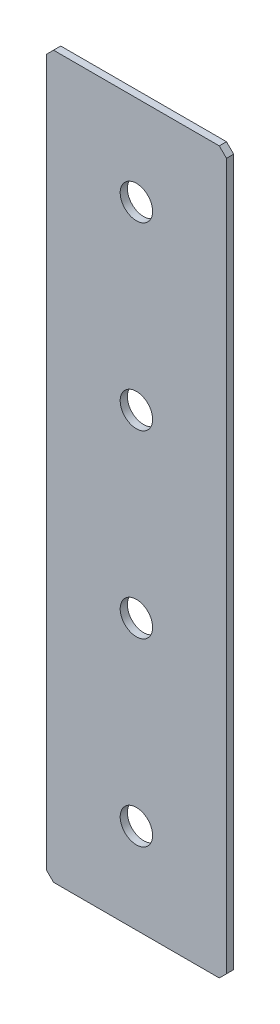
ISO-10303-21;
HEADER;
FILE_DESCRIPTION(('STEP AP214'),'2;1');
FILE_NAME('part.step','',(''),(''),'','','');
FILE_SCHEMA(('AUTOMOTIVE_DESIGN { 1 0 10303 214 1 1 1 1 }'));
ENDSEC;
DATA;
#1=APPLICATION_CONTEXT('core data for automotive mechanical design processes');
#2=APPLICATION_PROTOCOL_DEFINITION('international standard','automotive_design',2000,#1);
#3=PRODUCT_CONTEXT('',#1,'mechanical');
#4=PRODUCT('Part','Part','',(#3));
#5=PRODUCT_RELATED_PRODUCT_CATEGORY('part','',(#4));
#6=PRODUCT_DEFINITION_FORMATION('','',#4);
#7=PRODUCT_DEFINITION_CONTEXT('part definition',#1,'design');
#8=PRODUCT_DEFINITION('design','',#6,#7);
#9=PRODUCT_DEFINITION_SHAPE('','',#8);
#10=(LENGTH_UNIT() NAMED_UNIT(*) SI_UNIT(.MILLI.,.METRE.));
#11=(NAMED_UNIT(*) PLANE_ANGLE_UNIT() SI_UNIT($,.RADIAN.));
#12=(NAMED_UNIT(*) SI_UNIT($,.STERADIAN.) SOLID_ANGLE_UNIT());
#13=UNCERTAINTY_MEASURE_WITH_UNIT(LENGTH_MEASURE(1.E-05),#10,'distance_accuracy_value','');
#14=(GEOMETRIC_REPRESENTATION_CONTEXT(3) GLOBAL_UNCERTAINTY_ASSIGNED_CONTEXT((#13)) GLOBAL_UNIT_ASSIGNED_CONTEXT((#10,
#11,#12)) REPRESENTATION_CONTEXT('',''));
#15=CARTESIAN_POINT('',(0.,0.,0.));
#16=DIRECTION('',(0.,0.,1.));
#17=DIRECTION('',(1.,0.,0.));
#18=AXIS2_PLACEMENT_3D('',#15,#16,#17);
#19=CARTESIAN_POINT('',(25.,-100.,2.));
#20=DIRECTION('',(-1.,0.,0.));
#21=DIRECTION('',(0.,0.,1.));
#22=AXIS2_PLACEMENT_3D('',#19,#20,#21);
#23=PLANE('',#22);
#24=DIRECTION('',(0.,1.,0.));
#25=VECTOR('',#24,1.);
#26=CARTESIAN_POINT('',(25.,-100.,2.));
#27=LINE('',#26,#25);
#28=CARTESIAN_POINT('',(25.,-98.,2.));
#29=VERTEX_POINT('',#28);
#30=CARTESIAN_POINT('',(25.,98.,2.));
#31=VERTEX_POINT('',#30);
#32=EDGE_CURVE('E128',#29,#31,#27,.T.);
#33=ORIENTED_EDGE('',*,*,#32,.F.);
#34=DIRECTION('',(0.,0.,-1.));
#35=VECTOR('',#34,1.);
#36=CARTESIAN_POINT('',(25.,-98.,2.));
#37=LINE('',#36,#35);
#38=CARTESIAN_POINT('',(25.,-98.,0.));
#39=VERTEX_POINT('',#38);
#40=EDGE_CURVE('E154',#29,#39,#37,.T.);
#41=ORIENTED_EDGE('',*,*,#40,.T.);
#42=DIRECTION('',(0.,1.,0.));
#43=VECTOR('',#42,1.);
#44=CARTESIAN_POINT('',(25.,-100.,0.));
#45=LINE('',#44,#43);
#46=CARTESIAN_POINT('',(25.,98.,0.));
#47=VERTEX_POINT('',#46);
#48=EDGE_CURVE('E162',#39,#47,#45,.T.);
#49=ORIENTED_EDGE('',*,*,#48,.T.);
#50=DIRECTION('',(0.,0.,1.));
#51=VECTOR('',#50,1.);
#52=CARTESIAN_POINT('',(25.,98.,2.));
#53=LINE('',#52,#51);
#54=EDGE_CURVE('E152',#47,#31,#53,.T.);
#55=ORIENTED_EDGE('',*,*,#54,.T.);
#56=EDGE_LOOP('',(#33,#41,#49,#55));
#57=FACE_BOUND('',#56,.T.);
#58=ADVANCED_FACE('F37',(#57),#23,.F.);
#59=CARTESIAN_POINT('',(-25.,100.,2.));
#60=DIRECTION('',(0.,-1.,0.));
#61=DIRECTION('',(0.,0.,-1.));
#62=AXIS2_PLACEMENT_3D('',#59,#60,#61);
#63=PLANE('',#62);
#64=DIRECTION('',(-1.,0.,0.));
#65=VECTOR('',#64,1.);
#66=CARTESIAN_POINT('',(-25.,100.,0.));
#67=LINE('',#66,#65);
#68=CARTESIAN_POINT('',(23.,100.,0.));
#69=VERTEX_POINT('',#68);
#70=CARTESIAN_POINT('',(-22.9999999999999,100.,0.));
#71=VERTEX_POINT('',#70);
#72=EDGE_CURVE('E133',#69,#71,#67,.T.);
#73=ORIENTED_EDGE('',*,*,#72,.T.);
#74=DIRECTION('',(0.,0.,1.));
#75=VECTOR('',#74,1.);
#76=CARTESIAN_POINT('',(-22.9999999999999,100.,2.));
#77=LINE('',#76,#75);
#78=CARTESIAN_POINT('',(-22.9999999999999,100.,2.));
#79=VERTEX_POINT('',#78);
#80=EDGE_CURVE('E11',#71,#79,#77,.T.);
#81=ORIENTED_EDGE('',*,*,#80,.T.);
#82=DIRECTION('',(-1.,0.,0.));
#83=VECTOR('',#82,1.);
#84=CARTESIAN_POINT('',(-25.,100.,2.));
#85=LINE('',#84,#83);
#86=CARTESIAN_POINT('',(23.,100.,2.));
#87=VERTEX_POINT('',#86);
#88=EDGE_CURVE('E131',#87,#79,#85,.T.);
#89=ORIENTED_EDGE('',*,*,#88,.F.);
#90=DIRECTION('',(0.,0.,-1.));
#91=VECTOR('',#90,1.);
#92=CARTESIAN_POINT('',(23.,100.,2.));
#93=LINE('',#92,#91);
#94=EDGE_CURVE('E45',#87,#69,#93,.T.);
#95=ORIENTED_EDGE('',*,*,#94,.T.);
#96=EDGE_LOOP('',(#73,#81,#89,#95));
#97=FACE_BOUND('',#96,.T.);
#98=ADVANCED_FACE('F159',(#97),#63,.F.);
#99=CARTESIAN_POINT('',(-25.,-100.,2.));
#100=DIRECTION('',(1.,0.,0.));
#101=DIRECTION('',(0.,0.,-1.));
#102=AXIS2_PLACEMENT_3D('',#99,#100,#101);
#103=PLANE('',#102);
#104=DIRECTION('',(0.,-1.,0.));
#105=VECTOR('',#104,1.);
#106=CARTESIAN_POINT('',(-25.,-100.,0.));
#107=LINE('',#106,#105);
#108=CARTESIAN_POINT('',(-25.,98.,0.));
#109=VERTEX_POINT('',#108);
#110=CARTESIAN_POINT('',(-25.,-98.,0.));
#111=VERTEX_POINT('',#110);
#112=EDGE_CURVE('E129',#109,#111,#107,.T.);
#113=ORIENTED_EDGE('',*,*,#112,.T.);
#114=DIRECTION('',(0.,0.,1.));
#115=VECTOR('',#114,1.);
#116=CARTESIAN_POINT('',(-25.,-98.,2.));
#117=LINE('',#116,#115);
#118=CARTESIAN_POINT('',(-25.,-98.,2.));
#119=VERTEX_POINT('',#118);
#120=EDGE_CURVE('E107',#111,#119,#117,.T.);
#121=ORIENTED_EDGE('',*,*,#120,.T.);
#122=DIRECTION('',(0.,-1.,0.));
#123=VECTOR('',#122,1.);
#124=CARTESIAN_POINT('',(-25.,-100.,2.));
#125=LINE('',#124,#123);
#126=CARTESIAN_POINT('',(-25.,98.,2.));
#127=VERTEX_POINT('',#126);
#128=EDGE_CURVE('E167',#127,#119,#125,.T.);
#129=ORIENTED_EDGE('',*,*,#128,.F.);
#130=DIRECTION('',(0.,0.,-1.));
#131=VECTOR('',#130,1.);
#132=CARTESIAN_POINT('',(-25.,98.,2.));
#133=LINE('',#132,#131);
#134=EDGE_CURVE('E112',#127,#109,#133,.T.);
#135=ORIENTED_EDGE('',*,*,#134,.T.);
#136=EDGE_LOOP('',(#113,#121,#129,#135));
#137=FACE_BOUND('',#136,.T.);
#138=ADVANCED_FACE('F210',(#137),#103,.F.);
#139=CARTESIAN_POINT('',(-25.,-100.,2.));
#140=DIRECTION('',(0.,1.,0.));
#141=DIRECTION('',(0.,0.,1.));
#142=AXIS2_PLACEMENT_3D('',#139,#140,#141);
#143=PLANE('',#142);
#144=DIRECTION('',(1.,0.,0.));
#145=VECTOR('',#144,1.);
#146=CARTESIAN_POINT('',(-25.,-100.,2.));
#147=LINE('',#146,#145);
#148=CARTESIAN_POINT('',(-23.,-100.,2.));
#149=VERTEX_POINT('',#148);
#150=CARTESIAN_POINT('',(23.,-100.,2.));
#151=VERTEX_POINT('',#150);
#152=EDGE_CURVE('E122',#149,#151,#147,.T.);
#153=ORIENTED_EDGE('',*,*,#152,.F.);
#154=DIRECTION('',(0.,0.,-1.));
#155=VECTOR('',#154,1.);
#156=CARTESIAN_POINT('',(-23.,-100.,2.));
#157=LINE('',#156,#155);
#158=CARTESIAN_POINT('',(-23.,-100.,0.));
#159=VERTEX_POINT('',#158);
#160=EDGE_CURVE('E106',#149,#159,#157,.T.);
#161=ORIENTED_EDGE('',*,*,#160,.T.);
#162=DIRECTION('',(1.,0.,0.));
#163=VECTOR('',#162,1.);
#164=CARTESIAN_POINT('',(-25.,-100.,0.));
#165=LINE('',#164,#163);
#166=CARTESIAN_POINT('',(23.,-100.,0.));
#167=VERTEX_POINT('',#166);
#168=EDGE_CURVE('E119',#159,#167,#165,.T.);
#169=ORIENTED_EDGE('',*,*,#168,.T.);
#170=DIRECTION('',(0.,0.,1.));
#171=VECTOR('',#170,1.);
#172=CARTESIAN_POINT('',(23.,-100.,2.));
#173=LINE('',#172,#171);
#174=EDGE_CURVE('E124',#167,#151,#173,.T.);
#175=ORIENTED_EDGE('',*,*,#174,.T.);
#176=EDGE_LOOP('',(#153,#161,#169,#175));
#177=FACE_BOUND('',#176,.T.);
#178=ADVANCED_FACE('F118',(#177),#143,.F.);
#179=CARTESIAN_POINT('',(0.,0.,2.));
#180=DIRECTION('',(0.,0.,-1.));
#181=DIRECTION('',(-1.,0.,0.));
#182=AXIS2_PLACEMENT_3D('',#179,#180,#181);
#183=PLANE('',#182);
#184=CARTESIAN_POINT('',(0.,75.,2.));
#185=DIRECTION('',(0.,0.,1.));
#186=DIRECTION('',(1.,0.,0.));
#187=AXIS2_PLACEMENT_3D('',#184,#185,#186);
#188=CIRCLE('',#187,4.5);
#189=CARTESIAN_POINT('',(4.50000000000001,75.,2.));
#190=VERTEX_POINT('',#189);
#191=EDGE_CURVE('E191',#190,#190,#188,.T.);
#192=ORIENTED_EDGE('',*,*,#191,.F.);
#193=EDGE_LOOP('',(#192));
#194=FACE_BOUND('',#193,.T.);
#195=CARTESIAN_POINT('',(0.,25.,2.));
#196=DIRECTION('',(0.,0.,1.));
#197=DIRECTION('',(1.,0.,0.));
#198=AXIS2_PLACEMENT_3D('',#195,#196,#197);
#199=CIRCLE('',#198,4.5);
#200=CARTESIAN_POINT('',(4.50000000000001,25.,2.));
#201=VERTEX_POINT('',#200);
#202=EDGE_CURVE('E185',#201,#201,#199,.T.);
#203=ORIENTED_EDGE('',*,*,#202,.F.);
#204=EDGE_LOOP('',(#203));
#205=FACE_BOUND('',#204,.T.);
#206=CARTESIAN_POINT('',(0.,-25.,2.));
#207=DIRECTION('',(0.,0.,1.));
#208=DIRECTION('',(1.,0.,0.));
#209=AXIS2_PLACEMENT_3D('',#206,#207,#208);
#210=CIRCLE('',#209,4.5);
#211=CARTESIAN_POINT('',(4.50000000000001,-25.,2.));
#212=VERTEX_POINT('',#211);
#213=EDGE_CURVE('E179',#212,#212,#210,.T.);
#214=ORIENTED_EDGE('',*,*,#213,.F.);
#215=EDGE_LOOP('',(#214));
#216=FACE_BOUND('',#215,.T.);
#217=CARTESIAN_POINT('',(0.,-75.,2.));
#218=DIRECTION('',(0.,0.,1.));
#219=DIRECTION('',(1.,0.,0.));
#220=AXIS2_PLACEMENT_3D('',#217,#218,#219);
#221=CIRCLE('',#220,4.5);
#222=CARTESIAN_POINT('',(4.50000000000001,-75.,2.));
#223=VERTEX_POINT('',#222);
#224=EDGE_CURVE('E173',#223,#223,#221,.T.);
#225=ORIENTED_EDGE('',*,*,#224,.F.);
#226=EDGE_LOOP('',(#225));
#227=FACE_BOUND('',#226,.T.);
#228=ORIENTED_EDGE('',*,*,#128,.T.);
#229=DIRECTION('',(-0.707106781186548,0.707106781186548,0.));
#230=VECTOR('',#229,1.);
#231=CARTESIAN_POINT('',(-23.,-100.,2.));
#232=LINE('',#231,#230);
#233=EDGE_CURVE('E150',#119,#149,#232,.F.);
#234=ORIENTED_EDGE('',*,*,#233,.T.);
#235=ORIENTED_EDGE('',*,*,#152,.T.);
#236=DIRECTION('',(-0.707106781186548,-0.707106781186548,0.));
#237=VECTOR('',#236,1.);
#238=CARTESIAN_POINT('',(25.,-98.,2.));
#239=LINE('',#238,#237);
#240=EDGE_CURVE('E148',#151,#29,#239,.F.);
#241=ORIENTED_EDGE('',*,*,#240,.T.);
#242=ORIENTED_EDGE('',*,*,#32,.T.);
#243=DIRECTION('',(0.707106781186548,-0.707106781186548,0.));
#244=VECTOR('',#243,1.);
#245=CARTESIAN_POINT('',(23.,100.,2.));
#246=LINE('',#245,#244);
#247=EDGE_CURVE('E57',#31,#87,#246,.F.);
#248=ORIENTED_EDGE('',*,*,#247,.T.);
#249=ORIENTED_EDGE('',*,*,#88,.T.);
#250=DIRECTION('',(0.707106781186552,0.707106781186543,0.));
#251=VECTOR('',#250,1.);
#252=CARTESIAN_POINT('',(-25.,98.,2.));
#253=LINE('',#252,#251);
#254=EDGE_CURVE('E146',#79,#127,#253,.F.);
#255=ORIENTED_EDGE('',*,*,#254,.T.);
#256=EDGE_LOOP('',(#228,#234,#235,#241,#242,#248,#249,#255));
#257=FACE_BOUND('',#256,.T.);
#258=ADVANCED_FACE('F197',(#194,#205,#216,#227,#257),#183,.F.);
#259=CARTESIAN_POINT('',(0.,0.,0.));
#260=DIRECTION('',(0.,0.,-1.));
#261=DIRECTION('',(-1.,0.,0.));
#262=AXIS2_PLACEMENT_3D('',#259,#260,#261);
#263=PLANE('',#262);
#264=CARTESIAN_POINT('',(0.,75.,0.));
#265=DIRECTION('',(0.,0.,1.));
#266=DIRECTION('',(1.,0.,0.));
#267=AXIS2_PLACEMENT_3D('',#264,#265,#266);
#268=CIRCLE('',#267,4.5);
#269=CARTESIAN_POINT('',(4.50000000000001,75.,0.));
#270=VERTEX_POINT('',#269);
#271=EDGE_CURVE('E188',#270,#270,#268,.T.);
#272=ORIENTED_EDGE('',*,*,#271,.T.);
#273=EDGE_LOOP('',(#272));
#274=FACE_BOUND('',#273,.T.);
#275=CARTESIAN_POINT('',(0.,25.,0.));
#276=DIRECTION('',(0.,0.,1.));
#277=DIRECTION('',(1.,0.,0.));
#278=AXIS2_PLACEMENT_3D('',#275,#276,#277);
#279=CIRCLE('',#278,4.5);
#280=CARTESIAN_POINT('',(4.50000000000001,25.,0.));
#281=VERTEX_POINT('',#280);
#282=EDGE_CURVE('E182',#281,#281,#279,.T.);
#283=ORIENTED_EDGE('',*,*,#282,.T.);
#284=EDGE_LOOP('',(#283));
#285=FACE_BOUND('',#284,.T.);
#286=CARTESIAN_POINT('',(0.,-25.,0.));
#287=DIRECTION('',(0.,0.,1.));
#288=DIRECTION('',(1.,0.,0.));
#289=AXIS2_PLACEMENT_3D('',#286,#287,#288);
#290=CIRCLE('',#289,4.5);
#291=CARTESIAN_POINT('',(4.50000000000001,-25.,0.));
#292=VERTEX_POINT('',#291);
#293=EDGE_CURVE('E176',#292,#292,#290,.T.);
#294=ORIENTED_EDGE('',*,*,#293,.T.);
#295=EDGE_LOOP('',(#294));
#296=FACE_BOUND('',#295,.T.);
#297=CARTESIAN_POINT('',(0.,-75.,0.));
#298=DIRECTION('',(0.,0.,1.));
#299=DIRECTION('',(1.,0.,0.));
#300=AXIS2_PLACEMENT_3D('',#297,#298,#299);
#301=CIRCLE('',#300,4.5);
#302=CARTESIAN_POINT('',(4.50000000000001,-75.,0.));
#303=VERTEX_POINT('',#302);
#304=EDGE_CURVE('E163',#303,#303,#301,.T.);
#305=ORIENTED_EDGE('',*,*,#304,.T.);
#306=EDGE_LOOP('',(#305));
#307=FACE_BOUND('',#306,.T.);
#308=ORIENTED_EDGE('',*,*,#168,.F.);
#309=DIRECTION('',(0.707106781186548,-0.707106781186548,0.));
#310=VECTOR('',#309,1.);
#311=CARTESIAN_POINT('',(-61.5,-61.5,0.));
#312=LINE('',#311,#310);
#313=EDGE_CURVE('E102',#159,#111,#312,.F.);
#314=ORIENTED_EDGE('',*,*,#313,.T.);
#315=ORIENTED_EDGE('',*,*,#112,.F.);
#316=DIRECTION('',(-0.707106781186552,-0.707106781186543,0.));
#317=VECTOR('',#316,1.);
#318=CARTESIAN_POINT('',(-61.4999999999998,61.5000000000007,0.));
#319=LINE('',#318,#317);
#320=EDGE_CURVE('E139',#109,#71,#319,.F.);
#321=ORIENTED_EDGE('',*,*,#320,.T.);
#322=ORIENTED_EDGE('',*,*,#72,.F.);
#323=DIRECTION('',(-0.707106781186548,0.707106781186548,0.));
#324=VECTOR('',#323,1.);
#325=CARTESIAN_POINT('',(61.5,61.5,0.));
#326=LINE('',#325,#324);
#327=EDGE_CURVE('E123',#69,#47,#326,.F.);
#328=ORIENTED_EDGE('',*,*,#327,.T.);
#329=ORIENTED_EDGE('',*,*,#48,.F.);
#330=DIRECTION('',(0.707106781186548,0.707106781186548,0.));
#331=VECTOR('',#330,1.);
#332=CARTESIAN_POINT('',(61.5,-61.5,0.));
#333=LINE('',#332,#331);
#334=EDGE_CURVE('E113',#39,#167,#333,.F.);
#335=ORIENTED_EDGE('',*,*,#334,.T.);
#336=EDGE_LOOP('',(#308,#314,#315,#321,#322,#328,#329,#335));
#337=FACE_BOUND('',#336,.T.);
#338=ADVANCED_FACE('F126',(#274,#285,#296,#307,#337),#263,.T.);
#339=CARTESIAN_POINT('',(-23.,-100.,2.));
#340=DIRECTION('',(0.707106781186547,0.707106781186547,0.));
#341=DIRECTION('',(0.,0.,-1.));
#342=AXIS2_PLACEMENT_3D('',#339,#340,#341);
#343=PLANE('',#342);
#344=ORIENTED_EDGE('',*,*,#233,.F.);
#345=ORIENTED_EDGE('',*,*,#120,.F.);
#346=ORIENTED_EDGE('',*,*,#313,.F.);
#347=ORIENTED_EDGE('',*,*,#160,.F.);
#348=EDGE_LOOP('',(#344,#345,#346,#347));
#349=FACE_BOUND('',#348,.T.);
#350=ADVANCED_FACE('F105',(#349),#343,.F.);
#351=CARTESIAN_POINT('',(25.,-98.,2.));
#352=DIRECTION('',(-0.707106781186547,0.707106781186547,0.));
#353=DIRECTION('',(0.,0.,-1.));
#354=AXIS2_PLACEMENT_3D('',#351,#352,#353);
#355=PLANE('',#354);
#356=ORIENTED_EDGE('',*,*,#240,.F.);
#357=ORIENTED_EDGE('',*,*,#174,.F.);
#358=ORIENTED_EDGE('',*,*,#334,.F.);
#359=ORIENTED_EDGE('',*,*,#40,.F.);
#360=EDGE_LOOP('',(#356,#357,#358,#359));
#361=FACE_BOUND('',#360,.T.);
#362=ADVANCED_FACE('F214',(#361),#355,.F.);
#363=CARTESIAN_POINT('',(-25.,98.,2.));
#364=DIRECTION('',(0.707106781186543,-0.707106781186552,0.));
#365=DIRECTION('',(0.,0.,-1.));
#366=AXIS2_PLACEMENT_3D('',#363,#364,#365);
#367=PLANE('',#366);
#368=ORIENTED_EDGE('',*,*,#254,.F.);
#369=ORIENTED_EDGE('',*,*,#80,.F.);
#370=ORIENTED_EDGE('',*,*,#320,.F.);
#371=ORIENTED_EDGE('',*,*,#134,.F.);
#372=EDGE_LOOP('',(#368,#369,#370,#371));
#373=FACE_BOUND('',#372,.T.);
#374=ADVANCED_FACE('F212',(#373),#367,.F.);
#375=CARTESIAN_POINT('',(23.,100.,2.));
#376=DIRECTION('',(-0.707106781186547,-0.707106781186547,0.));
#377=DIRECTION('',(0.,0.,-1.));
#378=AXIS2_PLACEMENT_3D('',#375,#376,#377);
#379=PLANE('',#378);
#380=ORIENTED_EDGE('',*,*,#247,.F.);
#381=ORIENTED_EDGE('',*,*,#54,.F.);
#382=ORIENTED_EDGE('',*,*,#327,.F.);
#383=ORIENTED_EDGE('',*,*,#94,.F.);
#384=EDGE_LOOP('',(#380,#381,#382,#383));
#385=FACE_BOUND('',#384,.T.);
#386=ADVANCED_FACE('F39',(#385),#379,.F.);
#387=CARTESIAN_POINT('',(0.,-75.,2.));
#388=DIRECTION('',(0.,0.,1.));
#389=DIRECTION('',(1.,0.,0.));
#390=AXIS2_PLACEMENT_3D('',#387,#388,#389);
#391=CYLINDRICAL_SURFACE('',#390,4.5);
#392=ORIENTED_EDGE('',*,*,#304,.F.);
#393=EDGE_LOOP('',(#392));
#394=FACE_BOUND('',#393,.T.);
#395=ORIENTED_EDGE('',*,*,#224,.T.);
#396=EDGE_LOOP('',(#395));
#397=FACE_BOUND('',#396,.T.);
#398=ADVANCED_FACE('F219',(#394,#397),#391,.F.);
#399=CARTESIAN_POINT('',(0.,-25.,2.));
#400=DIRECTION('',(0.,0.,1.));
#401=DIRECTION('',(1.,0.,0.));
#402=AXIS2_PLACEMENT_3D('',#399,#400,#401);
#403=CYLINDRICAL_SURFACE('',#402,4.5);
#404=ORIENTED_EDGE('',*,*,#293,.F.);
#405=EDGE_LOOP('',(#404));
#406=FACE_BOUND('',#405,.T.);
#407=ORIENTED_EDGE('',*,*,#213,.T.);
#408=EDGE_LOOP('',(#407));
#409=FACE_BOUND('',#408,.T.);
#410=ADVANCED_FACE('F274',(#406,#409),#403,.F.);
#411=CARTESIAN_POINT('',(0.,25.,2.));
#412=DIRECTION('',(0.,0.,1.));
#413=DIRECTION('',(1.,0.,0.));
#414=AXIS2_PLACEMENT_3D('',#411,#412,#413);
#415=CYLINDRICAL_SURFACE('',#414,4.5);
#416=ORIENTED_EDGE('',*,*,#282,.F.);
#417=EDGE_LOOP('',(#416));
#418=FACE_BOUND('',#417,.T.);
#419=ORIENTED_EDGE('',*,*,#202,.T.);
#420=EDGE_LOOP('',(#419));
#421=FACE_BOUND('',#420,.T.);
#422=ADVANCED_FACE('F283',(#418,#421),#415,.F.);
#423=CARTESIAN_POINT('',(0.,75.,2.));
#424=DIRECTION('',(0.,0.,1.));
#425=DIRECTION('',(1.,0.,0.));
#426=AXIS2_PLACEMENT_3D('',#423,#424,#425);
#427=CYLINDRICAL_SURFACE('',#426,4.5);
#428=ORIENTED_EDGE('',*,*,#271,.F.);
#429=EDGE_LOOP('',(#428));
#430=FACE_BOUND('',#429,.T.);
#431=ORIENTED_EDGE('',*,*,#191,.T.);
#432=EDGE_LOOP('',(#431));
#433=FACE_BOUND('',#432,.T.);
#434=ADVANCED_FACE('F195',(#430,#433),#427,.F.);
#435=CLOSED_SHELL('',(#58,#98,#138,#178,#258,#338,#350,#362,#374,#386,#398,#410,#422,#434));
#436=MANIFOLD_SOLID_BREP('B2',#435);
#437=ADVANCED_BREP_SHAPE_REPRESENTATION('',(#18,#436),#14);
#438=SHAPE_DEFINITION_REPRESENTATION(#9,#437);
ENDSEC;
END-ISO-10303-21;
